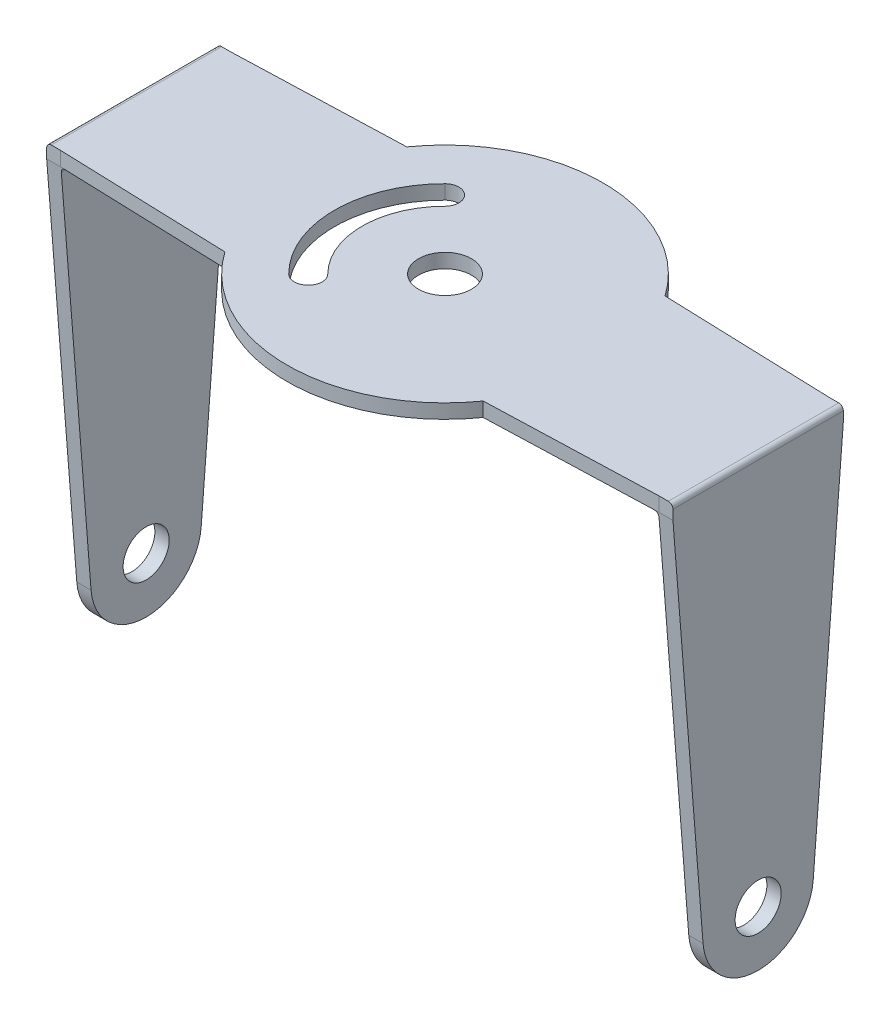
ISO-10303-21;
HEADER;
FILE_DESCRIPTION(('STEP AP214'),'2;1');
FILE_NAME('part.step','',(''),(''),'','','');
FILE_SCHEMA(('AUTOMOTIVE_DESIGN { 1 0 10303 214 1 1 1 1 }'));
ENDSEC;
DATA;
#1=APPLICATION_CONTEXT('core data for automotive mechanical design processes');
#2=APPLICATION_PROTOCOL_DEFINITION('international standard','automotive_design',2000,#1);
#3=PRODUCT_CONTEXT('',#1,'mechanical');
#4=PRODUCT('Part','Part','',(#3));
#5=PRODUCT_RELATED_PRODUCT_CATEGORY('part','',(#4));
#6=PRODUCT_DEFINITION_FORMATION('','',#4);
#7=PRODUCT_DEFINITION_CONTEXT('part definition',#1,'design');
#8=PRODUCT_DEFINITION('design','',#6,#7);
#9=PRODUCT_DEFINITION_SHAPE('','',#8);
#10=(LENGTH_UNIT() NAMED_UNIT(*) SI_UNIT(.MILLI.,.METRE.));
#11=(NAMED_UNIT(*) PLANE_ANGLE_UNIT() SI_UNIT($,.RADIAN.));
#12=(NAMED_UNIT(*) SI_UNIT($,.STERADIAN.) SOLID_ANGLE_UNIT());
#13=UNCERTAINTY_MEASURE_WITH_UNIT(LENGTH_MEASURE(1.E-05),#10,'distance_accuracy_value','');
#14=(GEOMETRIC_REPRESENTATION_CONTEXT(3) GLOBAL_UNCERTAINTY_ASSIGNED_CONTEXT((#13)) GLOBAL_UNIT_ASSIGNED_CONTEXT((#10,
#11,#12)) REPRESENTATION_CONTEXT('',''));
#15=CARTESIAN_POINT('',(0.,0.,0.));
#16=DIRECTION('',(0.,0.,1.));
#17=DIRECTION('',(1.,0.,0.));
#18=AXIS2_PLACEMENT_3D('',#15,#16,#17);
#19=CARTESIAN_POINT('',(34.,-6.,17.15));
#20=DIRECTION('',(-1.,0.,0.));
#21=DIRECTION('',(0.,0.,1.));
#22=AXIS2_PLACEMENT_3D('',#19,#20,#21);
#23=PLANE('',#22);
#24=CARTESIAN_POINT('',(34.,0.,0.));
#25=DIRECTION('',(-1.,0.,0.));
#26=DIRECTION('',(0.,0.,1.));
#27=AXIS2_PLACEMENT_3D('',#24,#25,#26);
#28=CIRCLE('',#27,2.5);
#29=CARTESIAN_POINT('',(34.,0.,2.5));
#30=VERTEX_POINT('',#29);
#31=EDGE_CURVE('E744',#30,#30,#28,.T.);
#32=ORIENTED_EDGE('',*,*,#31,.T.);
#33=EDGE_LOOP('',(#32));
#34=FACE_BOUND('',#33,.T.);
#35=DIRECTION('',(0.,1.,0.));
#36=VECTOR('',#35,1.);
#37=CARTESIAN_POINT('',(34.,-6.00000000000002,-9.25));
#38=LINE('',#37,#36);
#39=CARTESIAN_POINT('',(34.,40.95,-9.25));
#40=VERTEX_POINT('',#39);
#41=CARTESIAN_POINT('',(34.,42.,-9.25));
#42=VERTEX_POINT('',#41);
#43=EDGE_CURVE('E261',#40,#42,#38,.T.);
#44=ORIENTED_EDGE('',*,*,#43,.T.);
#45=DIRECTION('',(0.,0.,-1.));
#46=VECTOR('',#45,1.);
#47=CARTESIAN_POINT('',(34.,42.,17.15));
#48=LINE('',#47,#46);
#49=CARTESIAN_POINT('',(34.,42.,9.25));
#50=VERTEX_POINT('',#49);
#51=EDGE_CURVE('E389',#42,#50,#48,.F.);
#52=ORIENTED_EDGE('',*,*,#51,.T.);
#53=DIRECTION('',(0.,1.,0.));
#54=VECTOR('',#53,1.);
#55=CARTESIAN_POINT('',(34.,-6.00000000000002,9.25));
#56=LINE('',#55,#54);
#57=CARTESIAN_POINT('',(34.,40.95,9.25));
#58=VERTEX_POINT('',#57);
#59=EDGE_CURVE('E265',#58,#50,#56,.T.);
#60=ORIENTED_EDGE('',*,*,#59,.F.);
#61=DIRECTION('',(0.,0.996901100707089,0.0786650837983044));
#62=VECTOR('',#61,1.);
#63=CARTESIAN_POINT('',(34.,-0.471990502789828,5.98140660424254));
#64=LINE('',#63,#62);
#65=CARTESIAN_POINT('',(34.,-0.471990502789828,5.98140660424254));
#66=VERTEX_POINT('',#65);
#67=EDGE_CURVE('E330',#66,#58,#64,.T.);
#68=ORIENTED_EDGE('',*,*,#67,.F.);
#69=CARTESIAN_POINT('',(34.,0.,0.));
#70=DIRECTION('',(1.,0.,0.));
#71=DIRECTION('',(0.,0.,1.));
#72=AXIS2_PLACEMENT_3D('',#69,#70,#71);
#73=CIRCLE('',#72,6.00000000000001);
#74=CARTESIAN_POINT('',(34.,-0.471990502789828,-5.98140660424254));
#75=VERTEX_POINT('',#74);
#76=EDGE_CURVE('E351',#66,#75,#73,.T.);
#77=ORIENTED_EDGE('',*,*,#76,.T.);
#78=DIRECTION('',(0.,0.996901100707089,-0.0786650837983044));
#79=VECTOR('',#78,1.);
#80=CARTESIAN_POINT('',(34.,-0.471990502789828,-5.98140660424254));
#81=LINE('',#80,#79);
#82=EDGE_CURVE('E354',#75,#40,#81,.T.);
#83=ORIENTED_EDGE('',*,*,#82,.T.);
#84=EDGE_LOOP('',(#44,#52,#60,#68,#77,#83));
#85=FACE_BOUND('',#84,.T.);
#86=ADVANCED_FACE('F33',(#34,#85),#23,.F.);
#87=CARTESIAN_POINT('',(-32.45,40.95,17.15));
#88=DIRECTION('',(0.,1.,0.));
#89=DIRECTION('',(-1.,0.,0.));
#90=AXIS2_PLACEMENT_3D('',#87,#88,#89);
#91=PLANE('',#90);
#92=CARTESIAN_POINT('',(0.,40.95,0.));
#93=DIRECTION('',(0.,1.,0.));
#94=DIRECTION('',(-1.,0.,0.));
#95=AXIS2_PLACEMENT_3D('',#92,#93,#94);
#96=CIRCLE('',#95,2.875);
#97=CARTESIAN_POINT('',(-2.875,40.95,0.));
#98=VERTEX_POINT('',#97);
#99=EDGE_CURVE('E253',#98,#98,#96,.T.);
#100=ORIENTED_EDGE('',*,*,#99,.T.);
#101=EDGE_LOOP('',(#100));
#102=FACE_BOUND('',#101,.T.);
#103=CARTESIAN_POINT('',(0.,40.95,0.));
#104=DIRECTION('',(0.,1.,0.));
#105=DIRECTION('',(-1.,0.,0.));
#106=AXIS2_PLACEMENT_3D('',#103,#104,#105);
#107=CIRCLE('',#106,9.00000000000001);
#108=CARTESIAN_POINT('',(-6.36396103067892,40.95,6.36396103067894));
#109=VERTEX_POINT('',#108);
#110=CARTESIAN_POINT('',(-6.36396103067892,40.95,-6.36396103067894));
#111=VERTEX_POINT('',#110);
#112=EDGE_CURVE('E247',#109,#111,#107,.F.);
#113=ORIENTED_EDGE('',*,*,#112,.T.);
#114=CARTESIAN_POINT('',(-7.42462120245874,40.95,-7.42462120245877));
#115=DIRECTION('',(0.,1.,0.));
#116=DIRECTION('',(-1.,0.,0.));
#117=AXIS2_PLACEMENT_3D('',#114,#115,#116);
#118=CIRCLE('',#117,1.5);
#119=CARTESIAN_POINT('',(-8.48528137423856,40.95,-8.48528137423859));
#120=VERTEX_POINT('',#119);
#121=EDGE_CURVE('E250',#111,#120,#118,.T.);
#122=ORIENTED_EDGE('',*,*,#121,.T.);
#123=CARTESIAN_POINT('',(0.,40.95,0.));
#124=DIRECTION('',(0.,1.,0.));
#125=DIRECTION('',(-1.,0.,0.));
#126=AXIS2_PLACEMENT_3D('',#123,#124,#125);
#127=CIRCLE('',#126,12.);
#128=CARTESIAN_POINT('',(-8.48528137423856,40.95,8.48528137423859));
#129=VERTEX_POINT('',#128);
#130=EDGE_CURVE('E244',#120,#129,#127,.T.);
#131=ORIENTED_EDGE('',*,*,#130,.T.);
#132=CARTESIAN_POINT('',(-7.42462120245874,40.95,7.42462120245877));
#133=DIRECTION('',(0.,1.,0.));
#134=DIRECTION('',(-1.,0.,0.));
#135=AXIS2_PLACEMENT_3D('',#132,#133,#134);
#136=CIRCLE('',#135,1.5);
#137=EDGE_CURVE('E216',#129,#109,#136,.T.);
#138=ORIENTED_EDGE('',*,*,#137,.T.);
#139=EDGE_LOOP('',(#113,#122,#131,#138));
#140=FACE_BOUND('',#139,.T.);
#141=DIRECTION('',(-1.,0.,0.));
#142=VECTOR('',#141,1.);
#143=CARTESIAN_POINT('',(34.,40.95,-9.25));
#144=LINE('',#143,#142);
#145=CARTESIAN_POINT('',(32.5,40.95,-9.25));
#146=VERTEX_POINT('',#145);
#147=CARTESIAN_POINT('',(31.95,40.95,-9.25));
#148=VERTEX_POINT('',#147);
#149=EDGE_CURVE('E366',#146,#148,#144,.T.);
#150=ORIENTED_EDGE('',*,*,#149,.T.);
#151=DIRECTION('',(0.,0.,-1.));
#152=VECTOR('',#151,1.);
#153=CARTESIAN_POINT('',(31.95,40.95,9.25));
#154=LINE('',#153,#152);
#155=CARTESIAN_POINT('',(31.95,40.95,9.25));
#156=VERTEX_POINT('',#155);
#157=EDGE_CURVE('E399',#148,#156,#154,.F.);
#158=ORIENTED_EDGE('',*,*,#157,.T.);
#159=DIRECTION('',(-1.,0.,0.));
#160=VECTOR('',#159,1.);
#161=CARTESIAN_POINT('',(34.,40.95,9.25));
#162=LINE('',#161,#160);
#163=CARTESIAN_POINT('',(32.5,40.95,9.25));
#164=VERTEX_POINT('',#163);
#165=EDGE_CURVE('E344',#164,#156,#162,.T.);
#166=ORIENTED_EDGE('',*,*,#165,.F.);
#167=DIRECTION('',(0.999428479818494,0.,-0.033804048983714));
#168=VECTOR('',#167,1.);
#169=CARTESIAN_POINT('',(-32.6426801047576,40.95,11.4533456056721));
#170=LINE('',#169,#168);
#171=CARTESIAN_POINT('',(14.0216573556766,40.95,9.875));
#172=VERTEX_POINT('',#171);
#173=EDGE_CURVE('E287',#172,#164,#170,.T.);
#174=ORIENTED_EDGE('',*,*,#173,.F.);
#175=CARTESIAN_POINT('',(0.,40.95,0.));
#176=DIRECTION('',(0.,1.,0.));
#177=DIRECTION('',(-1.,0.,0.));
#178=AXIS2_PLACEMENT_3D('',#175,#176,#177);
#179=CIRCLE('',#178,17.15);
#180=CARTESIAN_POINT('',(-14.0216573556766,40.95,9.875));
#181=VERTEX_POINT('',#180);
#182=EDGE_CURVE('E323',#172,#181,#179,.F.);
#183=ORIENTED_EDGE('',*,*,#182,.T.);
#184=DIRECTION('',(-0.999428479818494,0.,-0.033804048983714));
#185=VECTOR('',#184,1.);
#186=CARTESIAN_POINT('',(-32.1831577743151,40.95,9.26071667491315));
#187=LINE('',#186,#185);
#188=CARTESIAN_POINT('',(-32.5,40.95,9.25));
#189=VERTEX_POINT('',#188);
#190=EDGE_CURVE('E326',#181,#189,#187,.T.);
#191=ORIENTED_EDGE('',*,*,#190,.T.);
#192=CARTESIAN_POINT('',(-31.95,40.95,9.25));
#193=VERTEX_POINT('',#192);
#194=EDGE_CURVE('E345',#193,#189,#162,.T.);
#195=ORIENTED_EDGE('',*,*,#194,.F.);
#196=DIRECTION('',(0.,0.,-1.));
#197=VECTOR('',#196,1.);
#198=CARTESIAN_POINT('',(-31.95,40.95,-9.25));
#199=LINE('',#198,#197);
#200=CARTESIAN_POINT('',(-31.95,40.95,-9.25));
#201=VERTEX_POINT('',#200);
#202=EDGE_CURVE('E396',#193,#201,#199,.T.);
#203=ORIENTED_EDGE('',*,*,#202,.T.);
#204=CARTESIAN_POINT('',(-32.5,40.95,-9.25));
#205=VERTEX_POINT('',#204);
#206=EDGE_CURVE('E367',#201,#205,#144,.T.);
#207=ORIENTED_EDGE('',*,*,#206,.T.);
#208=DIRECTION('',(0.999428479818494,0.,-0.033804048983714));
#209=VECTOR('',#208,1.);
#210=CARTESIAN_POINT('',(-33.3419739888765,40.95,-9.22152159405327));
#211=LINE('',#210,#209);
#212=CARTESIAN_POINT('',(-14.0216573556766,40.95,-9.875));
#213=VERTEX_POINT('',#212);
#214=EDGE_CURVE('E320',#205,#213,#211,.T.);
#215=ORIENTED_EDGE('',*,*,#214,.T.);
#216=CARTESIAN_POINT('',(0.,40.95,0.));
#217=DIRECTION('',(0.,1.,0.));
#218=DIRECTION('',(-1.,0.,0.));
#219=AXIS2_PLACEMENT_3D('',#216,#217,#218);
#220=CIRCLE('',#219,17.15);
#221=CARTESIAN_POINT('',(14.0216573556766,40.95,-9.875));
#222=VERTEX_POINT('',#221);
#223=EDGE_CURVE('E302',#213,#222,#220,.F.);
#224=ORIENTED_EDGE('',*,*,#223,.T.);
#225=DIRECTION('',(-0.999428479818494,0.,-0.033804048983714));
#226=VECTOR('',#225,1.);
#227=CARTESIAN_POINT('',(-31.4838638901962,40.95,-11.4141505248122));
#228=LINE('',#227,#226);
#229=EDGE_CURVE('E268',#146,#222,#228,.T.);
#230=ORIENTED_EDGE('',*,*,#229,.F.);
#231=EDGE_LOOP('',(#150,#158,#166,#174,#183,#191,#195,#203,#207,#215,#224,#230));
#232=FACE_BOUND('',#231,.T.);
#233=ADVANCED_FACE('F446',(#102,#140,#232),#91,.F.);
#234=CARTESIAN_POINT('',(-34.,42.5,17.15));
#235=DIRECTION('',(0.,-1.,0.));
#236=DIRECTION('',(1.,0.,0.));
#237=AXIS2_PLACEMENT_3D('',#234,#235,#236);
#238=PLANE('',#237);
#239=CARTESIAN_POINT('',(0.,42.5,0.));
#240=DIRECTION('',(0.,1.,0.));
#241=DIRECTION('',(-1.,0.,0.));
#242=AXIS2_PLACEMENT_3D('',#239,#240,#241);
#243=CIRCLE('',#242,2.875);
#244=CARTESIAN_POINT('',(-2.875,42.5,0.));
#245=VERTEX_POINT('',#244);
#246=EDGE_CURVE('E241',#245,#245,#243,.T.);
#247=ORIENTED_EDGE('',*,*,#246,.F.);
#248=EDGE_LOOP('',(#247));
#249=FACE_BOUND('',#248,.T.);
#250=CARTESIAN_POINT('',(0.,42.5,0.));
#251=DIRECTION('',(0.,1.,0.));
#252=DIRECTION('',(-1.,0.,0.));
#253=AXIS2_PLACEMENT_3D('',#250,#251,#252);
#254=CIRCLE('',#253,12.);
#255=CARTESIAN_POINT('',(-8.48528137423856,42.5,-8.48528137423859));
#256=VERTEX_POINT('',#255);
#257=CARTESIAN_POINT('',(-8.48528137423856,42.5,8.48528137423859));
#258=VERTEX_POINT('',#257);
#259=EDGE_CURVE('E224',#256,#258,#254,.T.);
#260=ORIENTED_EDGE('',*,*,#259,.F.);
#261=CARTESIAN_POINT('',(-7.42462120245874,42.5,-7.42462120245877));
#262=DIRECTION('',(0.,1.,0.));
#263=DIRECTION('',(-1.,0.,0.));
#264=AXIS2_PLACEMENT_3D('',#261,#262,#263);
#265=CIRCLE('',#264,1.5);
#266=CARTESIAN_POINT('',(-6.36396103067892,42.5,-6.36396103067894));
#267=VERTEX_POINT('',#266);
#268=EDGE_CURVE('E229',#267,#256,#265,.T.);
#269=ORIENTED_EDGE('',*,*,#268,.F.);
#270=CARTESIAN_POINT('',(0.,42.5,0.));
#271=DIRECTION('',(0.,-1.,0.));
#272=DIRECTION('',(-1.,0.,0.));
#273=AXIS2_PLACEMENT_3D('',#270,#271,#272);
#274=CIRCLE('',#273,9.00000000000001);
#275=CARTESIAN_POINT('',(-6.36396103067892,42.5,6.36396103067894));
#276=VERTEX_POINT('',#275);
#277=EDGE_CURVE('E234',#276,#267,#274,.T.);
#278=ORIENTED_EDGE('',*,*,#277,.F.);
#279=CARTESIAN_POINT('',(-7.42462120245874,42.5,7.42462120245877));
#280=DIRECTION('',(0.,1.,0.));
#281=DIRECTION('',(-1.,0.,0.));
#282=AXIS2_PLACEMENT_3D('',#279,#280,#281);
#283=CIRCLE('',#282,1.5);
#284=EDGE_CURVE('E213',#258,#276,#283,.T.);
#285=ORIENTED_EDGE('',*,*,#284,.F.);
#286=EDGE_LOOP('',(#260,#269,#278,#285));
#287=FACE_BOUND('',#286,.T.);
#288=DIRECTION('',(1.,0.,0.));
#289=VECTOR('',#288,1.);
#290=CARTESIAN_POINT('',(32.5,42.5,9.25));
#291=LINE('',#290,#289);
#292=CARTESIAN_POINT('',(32.5,42.5,9.25));
#293=VERTEX_POINT('',#292);
#294=CARTESIAN_POINT('',(33.5,42.5,9.25));
#295=VERTEX_POINT('',#294);
#296=EDGE_CURVE('E257',#293,#295,#291,.T.);
#297=ORIENTED_EDGE('',*,*,#296,.T.);
#298=DIRECTION('',(0.,0.,-1.));
#299=VECTOR('',#298,1.);
#300=CARTESIAN_POINT('',(33.5,42.5,17.15));
#301=LINE('',#300,#299);
#302=CARTESIAN_POINT('',(33.5,42.5,-9.25));
#303=VERTEX_POINT('',#302);
#304=EDGE_CURVE('E384',#295,#303,#301,.T.);
#305=ORIENTED_EDGE('',*,*,#304,.T.);
#306=DIRECTION('',(-1.,0.,0.));
#307=VECTOR('',#306,1.);
#308=CARTESIAN_POINT('',(32.5,42.5,-9.25));
#309=LINE('',#308,#307);
#310=CARTESIAN_POINT('',(32.5,42.5,-9.25));
#311=VERTEX_POINT('',#310);
#312=EDGE_CURVE('E275',#303,#311,#309,.T.);
#313=ORIENTED_EDGE('',*,*,#312,.T.);
#314=DIRECTION('',(-0.999428479818494,0.,-0.033804048983714));
#315=VECTOR('',#314,1.);
#316=CARTESIAN_POINT('',(32.5,42.5,-9.25));
#317=LINE('',#316,#315);
#318=CARTESIAN_POINT('',(14.0216573556766,42.5,-9.875));
#319=VERTEX_POINT('',#318);
#320=EDGE_CURVE('E256',#311,#319,#317,.T.);
#321=ORIENTED_EDGE('',*,*,#320,.T.);
#322=CARTESIAN_POINT('',(0.,42.5,0.));
#323=DIRECTION('',(0.,-1.,0.));
#324=DIRECTION('',(1.,0.,0.));
#325=AXIS2_PLACEMENT_3D('',#322,#323,#324);
#326=CIRCLE('',#325,17.15);
#327=CARTESIAN_POINT('',(-14.0216573556766,42.5,-9.875));
#328=VERTEX_POINT('',#327);
#329=EDGE_CURVE('E289',#328,#319,#326,.T.);
#330=ORIENTED_EDGE('',*,*,#329,.F.);
#331=DIRECTION('',(0.999428479818494,0.,-0.033804048983714));
#332=VECTOR('',#331,1.);
#333=CARTESIAN_POINT('',(-32.5,42.5,-9.25));
#334=LINE('',#333,#332);
#335=CARTESIAN_POINT('',(-32.5,42.5,-9.25));
#336=VERTEX_POINT('',#335);
#337=EDGE_CURVE('E309',#336,#328,#334,.T.);
#338=ORIENTED_EDGE('',*,*,#337,.F.);
#339=DIRECTION('',(1.,0.,0.));
#340=VECTOR('',#339,1.);
#341=CARTESIAN_POINT('',(-32.5,42.5,-9.25));
#342=LINE('',#341,#340);
#343=CARTESIAN_POINT('',(-33.5,42.5,-9.25));
#344=VERTEX_POINT('',#343);
#345=EDGE_CURVE('E307',#344,#336,#342,.T.);
#346=ORIENTED_EDGE('',*,*,#345,.F.);
#347=DIRECTION('',(0.,0.,-1.));
#348=VECTOR('',#347,1.);
#349=CARTESIAN_POINT('',(-33.5,42.5,17.15));
#350=LINE('',#349,#348);
#351=CARTESIAN_POINT('',(-33.5,42.5,9.25));
#352=VERTEX_POINT('',#351);
#353=EDGE_CURVE('E382',#344,#352,#350,.F.);
#354=ORIENTED_EDGE('',*,*,#353,.T.);
#355=DIRECTION('',(-1.,0.,0.));
#356=VECTOR('',#355,1.);
#357=CARTESIAN_POINT('',(-32.5,42.5,9.25));
#358=LINE('',#357,#356);
#359=CARTESIAN_POINT('',(-32.5,42.5,9.25));
#360=VERTEX_POINT('',#359);
#361=EDGE_CURVE('E290',#360,#352,#358,.T.);
#362=ORIENTED_EDGE('',*,*,#361,.F.);
#363=DIRECTION('',(-0.999428479818494,0.,-0.033804048983714));
#364=VECTOR('',#363,1.);
#365=CARTESIAN_POINT('',(-32.5,42.5,9.25));
#366=LINE('',#365,#364);
#367=CARTESIAN_POINT('',(-14.0216573556766,42.5,9.875));
#368=VERTEX_POINT('',#367);
#369=EDGE_CURVE('E296',#368,#360,#366,.T.);
#370=ORIENTED_EDGE('',*,*,#369,.F.);
#371=CARTESIAN_POINT('',(0.,42.5,0.));
#372=DIRECTION('',(0.,-1.,0.));
#373=DIRECTION('',(-1.,0.,0.));
#374=AXIS2_PLACEMENT_3D('',#371,#372,#373);
#375=CIRCLE('',#374,17.15);
#376=CARTESIAN_POINT('',(14.0216573556766,42.5,9.875));
#377=VERTEX_POINT('',#376);
#378=EDGE_CURVE('E292',#377,#368,#375,.T.);
#379=ORIENTED_EDGE('',*,*,#378,.F.);
#380=DIRECTION('',(0.999428479818494,0.,-0.033804048983714));
#381=VECTOR('',#380,1.);
#382=CARTESIAN_POINT('',(32.5,42.5,9.25));
#383=LINE('',#382,#381);
#384=EDGE_CURVE('E260',#377,#293,#383,.T.);
#385=ORIENTED_EDGE('',*,*,#384,.T.);
#386=EDGE_LOOP('',(#297,#305,#313,#321,#330,#338,#346,#354,#362,#370,#379,#385));
#387=FACE_BOUND('',#386,.T.);
#388=ADVANCED_FACE('F231',(#249,#287,#387),#238,.F.);
#389=CARTESIAN_POINT('',(-32.45,-6.,17.15));
#390=DIRECTION('',(-1.,0.,0.));
#391=DIRECTION('',(0.,0.,1.));
#392=AXIS2_PLACEMENT_3D('',#389,#390,#391);
#393=PLANE('',#392);
#394=CARTESIAN_POINT('',(-32.45,0.,0.));
#395=DIRECTION('',(-1.,0.,0.));
#396=DIRECTION('',(0.,0.,1.));
#397=AXIS2_PLACEMENT_3D('',#394,#395,#396);
#398=CIRCLE('',#397,2.5);
#399=CARTESIAN_POINT('',(-32.45,0.,2.5));
#400=VERTEX_POINT('',#399);
#401=EDGE_CURVE('E748',#400,#400,#398,.T.);
#402=ORIENTED_EDGE('',*,*,#401,.T.);
#403=EDGE_LOOP('',(#402));
#404=FACE_BOUND('',#403,.T.);
#405=DIRECTION('',(0.,0.996901100707089,-0.0786650837983044));
#406=VECTOR('',#405,1.);
#407=CARTESIAN_POINT('',(-32.45,-7.77978677326739,-5.40475120122382));
#408=LINE('',#407,#406);
#409=CARTESIAN_POINT('',(-32.45,-0.471990502789828,-5.98140660424254));
#410=VERTEX_POINT('',#409);
#411=CARTESIAN_POINT('',(-32.45,40.45,-9.21054519162307));
#412=VERTEX_POINT('',#411);
#413=EDGE_CURVE('E373',#410,#412,#408,.T.);
#414=ORIENTED_EDGE('',*,*,#413,.T.);
#415=DIRECTION('',(0.,0.,-1.));
#416=VECTOR('',#415,1.);
#417=CARTESIAN_POINT('',(-32.45,40.45,9.25));
#418=LINE('',#417,#416);
#419=CARTESIAN_POINT('',(-32.45,40.45,9.21054519162307));
#420=VERTEX_POINT('',#419);
#421=EDGE_CURVE('E402',#412,#420,#418,.F.);
#422=ORIENTED_EDGE('',*,*,#421,.T.);
#423=DIRECTION('',(0.,0.996901100707089,0.0786650837983044));
#424=VECTOR('',#423,1.);
#425=CARTESIAN_POINT('',(-32.45,-5.08993588740434,5.61700630375232));
#426=LINE('',#425,#424);
#427=CARTESIAN_POINT('',(-32.45,-0.471990502789828,5.98140660424254));
#428=VERTEX_POINT('',#427);
#429=EDGE_CURVE('E347',#428,#420,#426,.T.);
#430=ORIENTED_EDGE('',*,*,#429,.F.);
#431=CARTESIAN_POINT('',(-32.45,0.,0.));
#432=DIRECTION('',(-1.,0.,0.));
#433=DIRECTION('',(0.,0.,1.));
#434=AXIS2_PLACEMENT_3D('',#431,#432,#433);
#435=CIRCLE('',#434,6.00000000000001);
#436=EDGE_CURVE('E379',#428,#410,#435,.F.);
#437=ORIENTED_EDGE('',*,*,#436,.T.);
#438=EDGE_LOOP('',(#414,#422,#430,#437));
#439=FACE_BOUND('',#438,.T.);
#440=ADVANCED_FACE('F422',(#404,#439),#393,.F.);
#441=CARTESIAN_POINT('',(32.45,-6.,17.15));
#442=DIRECTION('',(1.,0.,0.));
#443=DIRECTION('',(0.,0.,-1.));
#444=AXIS2_PLACEMENT_3D('',#441,#442,#443);
#445=PLANE('',#444);
#446=CARTESIAN_POINT('',(32.45,0.,0.));
#447=DIRECTION('',(1.,0.,0.));
#448=DIRECTION('',(0.,0.,-1.));
#449=AXIS2_PLACEMENT_3D('',#446,#447,#448);
#450=CIRCLE('',#449,2.5);
#451=CARTESIAN_POINT('',(32.45,0.,-2.5));
#452=VERTEX_POINT('',#451);
#453=EDGE_CURVE('E747',#452,#452,#450,.T.);
#454=ORIENTED_EDGE('',*,*,#453,.T.);
#455=EDGE_LOOP('',(#454));
#456=FACE_BOUND('',#455,.T.);
#457=DIRECTION('',(0.,-0.996901100707089,-0.0786650837983044));
#458=VECTOR('',#457,1.);
#459=CARTESIAN_POINT('',(32.45,-5.08993588740433,5.61700630375232));
#460=LINE('',#459,#458);
#461=CARTESIAN_POINT('',(32.45,40.45,9.21054519162307));
#462=VERTEX_POINT('',#461);
#463=CARTESIAN_POINT('',(32.45,-0.471990502789828,5.98140660424254));
#464=VERTEX_POINT('',#463);
#465=EDGE_CURVE('E339',#462,#464,#460,.T.);
#466=ORIENTED_EDGE('',*,*,#465,.F.);
#467=DIRECTION('',(0.,0.,-1.));
#468=VECTOR('',#467,1.);
#469=CARTESIAN_POINT('',(32.45,40.45,-9.25));
#470=LINE('',#469,#468);
#471=CARTESIAN_POINT('',(32.45,40.45,-9.21054519162307));
#472=VERTEX_POINT('',#471);
#473=EDGE_CURVE('E393',#462,#472,#470,.T.);
#474=ORIENTED_EDGE('',*,*,#473,.T.);
#475=DIRECTION('',(0.,-0.996901100707089,0.0786650837983044));
#476=VECTOR('',#475,1.);
#477=CARTESIAN_POINT('',(32.45,-7.77978677326739,-5.40475120122382));
#478=LINE('',#477,#476);
#479=CARTESIAN_POINT('',(32.45,-0.471990502789828,-5.98140660424254));
#480=VERTEX_POINT('',#479);
#481=EDGE_CURVE('E365',#472,#480,#478,.T.);
#482=ORIENTED_EDGE('',*,*,#481,.T.);
#483=CARTESIAN_POINT('',(32.45,0.,0.));
#484=DIRECTION('',(1.,0.,0.));
#485=DIRECTION('',(0.,0.,-1.));
#486=AXIS2_PLACEMENT_3D('',#483,#484,#485);
#487=CIRCLE('',#486,6.00000000000001);
#488=EDGE_CURVE('E376',#480,#464,#487,.F.);
#489=ORIENTED_EDGE('',*,*,#488,.T.);
#490=EDGE_LOOP('',(#466,#474,#482,#489));
#491=FACE_BOUND('',#490,.T.);
#492=ADVANCED_FACE('F462',(#456,#491),#445,.F.);
#493=CARTESIAN_POINT('',(-34.,-6.,17.15));
#494=DIRECTION('',(1.,0.,0.));
#495=DIRECTION('',(0.,0.,-1.));
#496=AXIS2_PLACEMENT_3D('',#493,#494,#495);
#497=PLANE('',#496);
#498=CARTESIAN_POINT('',(-34.,0.,0.));
#499=DIRECTION('',(-1.,0.,0.));
#500=DIRECTION('',(0.,0.,1.));
#501=AXIS2_PLACEMENT_3D('',#498,#499,#500);
#502=CIRCLE('',#501,2.5);
#503=CARTESIAN_POINT('',(-34.,0.,2.5));
#504=VERTEX_POINT('',#503);
#505=EDGE_CURVE('E752',#504,#504,#502,.T.);
#506=ORIENTED_EDGE('',*,*,#505,.F.);
#507=EDGE_LOOP('',(#506));
#508=FACE_BOUND('',#507,.T.);
#509=DIRECTION('',(0.,1.,0.));
#510=VECTOR('',#509,1.);
#511=CARTESIAN_POINT('',(-34.,-6.00000000000002,9.25));
#512=LINE('',#511,#510);
#513=CARTESIAN_POINT('',(-34.,40.95,9.25));
#514=VERTEX_POINT('',#513);
#515=CARTESIAN_POINT('',(-34.,42.,9.25));
#516=VERTEX_POINT('',#515);
#517=EDGE_CURVE('E299',#514,#516,#512,.T.);
#518=ORIENTED_EDGE('',*,*,#517,.T.);
#519=DIRECTION('',(0.,0.,-1.));
#520=VECTOR('',#519,1.);
#521=CARTESIAN_POINT('',(-34.,42.,17.15));
#522=LINE('',#521,#520);
#523=CARTESIAN_POINT('',(-34.,42.,-9.25));
#524=VERTEX_POINT('',#523);
#525=EDGE_CURVE('E404',#516,#524,#522,.T.);
#526=ORIENTED_EDGE('',*,*,#525,.T.);
#527=DIRECTION('',(0.,1.,0.));
#528=VECTOR('',#527,1.);
#529=CARTESIAN_POINT('',(-34.,-6.00000000000002,-9.25));
#530=LINE('',#529,#528);
#531=CARTESIAN_POINT('',(-34.,40.95,-9.25));
#532=VERTEX_POINT('',#531);
#533=EDGE_CURVE('E312',#532,#524,#530,.T.);
#534=ORIENTED_EDGE('',*,*,#533,.F.);
#535=DIRECTION('',(0.,0.996901100707089,-0.0786650837983044));
#536=VECTOR('',#535,1.);
#537=CARTESIAN_POINT('',(-34.,-0.471990502789828,-5.98140660424254));
#538=LINE('',#537,#536);
#539=CARTESIAN_POINT('',(-34.,-0.471990502789828,-5.98140660424254));
#540=VERTEX_POINT('',#539);
#541=EDGE_CURVE('E355',#540,#532,#538,.T.);
#542=ORIENTED_EDGE('',*,*,#541,.F.);
#543=CARTESIAN_POINT('',(-34.,0.,0.));
#544=DIRECTION('',(1.,0.,0.));
#545=DIRECTION('',(0.,0.,1.));
#546=AXIS2_PLACEMENT_3D('',#543,#544,#545);
#547=CIRCLE('',#546,6.00000000000001);
#548=CARTESIAN_POINT('',(-34.,-0.471990502789828,5.98140660424254));
#549=VERTEX_POINT('',#548);
#550=EDGE_CURVE('E350',#549,#540,#547,.T.);
#551=ORIENTED_EDGE('',*,*,#550,.F.);
#552=DIRECTION('',(0.,0.996901100707089,0.0786650837983044));
#553=VECTOR('',#552,1.);
#554=CARTESIAN_POINT('',(-34.,-0.471990502789828,5.98140660424254));
#555=LINE('',#554,#553);
#556=EDGE_CURVE('E329',#549,#514,#555,.T.);
#557=ORIENTED_EDGE('',*,*,#556,.T.);
#558=EDGE_LOOP('',(#518,#526,#534,#542,#551,#557));
#559=FACE_BOUND('',#558,.T.);
#560=ADVANCED_FACE('F438',(#508,#559),#497,.F.);
#561=CARTESIAN_POINT('',(34.,-0.471990502789828,-5.98140660424254));
#562=DIRECTION('',(0.,0.0786650837983044,0.996901100707089));
#563=DIRECTION('',(0.,-0.996901100707089,0.0786650837983044));
#564=AXIS2_PLACEMENT_3D('',#561,#562,#563);
#565=PLANE('',#564);
#566=EDGE_CURVE('E363',#40,#146,#144,.T.);
#567=ORIENTED_EDGE('',*,*,#566,.F.);
#568=ORIENTED_EDGE('',*,*,#82,.F.);
#569=DIRECTION('',(-1.,0.,0.));
#570=VECTOR('',#569,1.);
#571=CARTESIAN_POINT('',(34.,-0.471990502789828,-5.98140660424254));
#572=LINE('',#571,#570);
#573=EDGE_CURVE('E368',#75,#480,#572,.T.);
#574=ORIENTED_EDGE('',*,*,#573,.T.);
#575=ORIENTED_EDGE('',*,*,#481,.F.);
#576=CARTESIAN_POINT('',(31.95,40.45,-9.21054519162307));
#577=DIRECTION('',(0.,0.0786650837983044,0.996901100707089));
#578=DIRECTION('',(0.,-0.996901100707089,0.0786650837983044));
#579=AXIS2_PLACEMENT_3D('',#576,#577,#578);
#580=ELLIPSE('',#579,0.501554266160762,0.5);
#581=EDGE_CURVE('E408',#472,#148,#580,.T.);
#582=ORIENTED_EDGE('',*,*,#581,.T.);
#583=ORIENTED_EDGE('',*,*,#149,.F.);
#584=EDGE_LOOP('',(#567,#568,#574,#575,#582,#583));
#585=FACE_BOUND('',#584,.T.);
#586=ADVANCED_FACE('F453',(#585),#565,.F.);
#587=CARTESIAN_POINT('',(34.,0.,0.));
#588=DIRECTION('',(-1.,0.,0.));
#589=DIRECTION('',(0.,0.,1.));
#590=AXIS2_PLACEMENT_3D('',#587,#588,#589);
#591=CYLINDRICAL_SURFACE('',#590,6.00000000000001);
#592=ORIENTED_EDGE('',*,*,#573,.F.);
#593=ORIENTED_EDGE('',*,*,#76,.F.);
#594=DIRECTION('',(-1.,0.,0.));
#595=VECTOR('',#594,1.);
#596=CARTESIAN_POINT('',(34.,-0.471990502789828,5.98140660424254));
#597=LINE('',#596,#595);
#598=EDGE_CURVE('E336',#66,#464,#597,.T.);
#599=ORIENTED_EDGE('',*,*,#598,.T.);
#600=ORIENTED_EDGE('',*,*,#488,.F.);
#601=EDGE_LOOP('',(#592,#593,#599,#600));
#602=FACE_BOUND('',#601,.T.);
#603=ADVANCED_FACE('F465',(#602),#591,.T.);
#604=ORIENTED_EDGE('',*,*,#436,.F.);
#605=EDGE_CURVE('E340',#428,#549,#597,.T.);
#606=ORIENTED_EDGE('',*,*,#605,.T.);
#607=ORIENTED_EDGE('',*,*,#550,.T.);
#608=EDGE_CURVE('E358',#410,#540,#572,.T.);
#609=ORIENTED_EDGE('',*,*,#608,.F.);
#610=EDGE_LOOP('',(#604,#606,#607,#609));
#611=FACE_BOUND('',#610,.T.);
#612=ADVANCED_FACE('F434',(#611),#591,.T.);
#613=ORIENTED_EDGE('',*,*,#608,.T.);
#614=ORIENTED_EDGE('',*,*,#541,.T.);
#615=EDGE_CURVE('E371',#205,#532,#144,.T.);
#616=ORIENTED_EDGE('',*,*,#615,.F.);
#617=ORIENTED_EDGE('',*,*,#206,.F.);
#618=CARTESIAN_POINT('',(-31.95,40.45,-9.21054519162307));
#619=DIRECTION('',(0.,0.0786650837983044,0.996901100707089));
#620=DIRECTION('',(0.,-0.996901100707089,0.0786650837983044));
#621=AXIS2_PLACEMENT_3D('',#618,#619,#620);
#622=ELLIPSE('',#621,0.501554266160762,0.5);
#623=EDGE_CURVE('E41',#201,#412,#622,.T.);
#624=ORIENTED_EDGE('',*,*,#623,.T.);
#625=ORIENTED_EDGE('',*,*,#413,.F.);
#626=EDGE_LOOP('',(#613,#614,#616,#617,#624,#625));
#627=FACE_BOUND('',#626,.T.);
#628=ADVANCED_FACE('F414',(#627),#565,.F.);
#629=CARTESIAN_POINT('',(34.,-0.471990502789828,5.98140660424254));
#630=DIRECTION('',(0.,-0.0786650837983044,0.996901100707089));
#631=DIRECTION('',(0.,-0.996901100707089,-0.0786650837983044));
#632=AXIS2_PLACEMENT_3D('',#629,#630,#631);
#633=PLANE('',#632);
#634=ORIENTED_EDGE('',*,*,#429,.T.);
#635=CARTESIAN_POINT('',(-31.95,40.45,9.21054519162307));
#636=DIRECTION('',(0.,-0.0786650837983044,0.996901100707089));
#637=DIRECTION('',(0.,0.996901100707089,0.0786650837983044));
#638=AXIS2_PLACEMENT_3D('',#635,#636,#637);
#639=ELLIPSE('',#638,0.501554266160762,0.5);
#640=EDGE_CURVE('E11',#420,#193,#639,.F.);
#641=ORIENTED_EDGE('',*,*,#640,.T.);
#642=ORIENTED_EDGE('',*,*,#194,.T.);
#643=EDGE_CURVE('E333',#189,#514,#162,.T.);
#644=ORIENTED_EDGE('',*,*,#643,.T.);
#645=ORIENTED_EDGE('',*,*,#556,.F.);
#646=ORIENTED_EDGE('',*,*,#605,.F.);
#647=EDGE_LOOP('',(#634,#641,#642,#644,#645,#646));
#648=FACE_BOUND('',#647,.T.);
#649=ADVANCED_FACE('F428',(#648),#633,.T.);
#650=ORIENTED_EDGE('',*,*,#165,.T.);
#651=CARTESIAN_POINT('',(31.95,40.45,9.21054519162307));
#652=DIRECTION('',(0.,-0.0786650837983044,0.996901100707089));
#653=DIRECTION('',(0.,0.996901100707089,0.0786650837983044));
#654=AXIS2_PLACEMENT_3D('',#651,#652,#653);
#655=ELLIPSE('',#654,0.501554266160762,0.5);
#656=EDGE_CURVE('E411',#156,#462,#655,.F.);
#657=ORIENTED_EDGE('',*,*,#656,.T.);
#658=ORIENTED_EDGE('',*,*,#465,.T.);
#659=ORIENTED_EDGE('',*,*,#598,.F.);
#660=ORIENTED_EDGE('',*,*,#67,.T.);
#661=EDGE_CURVE('E341',#58,#164,#162,.T.);
#662=ORIENTED_EDGE('',*,*,#661,.T.);
#663=EDGE_LOOP('',(#650,#657,#658,#659,#660,#662));
#664=FACE_BOUND('',#663,.T.);
#665=ADVANCED_FACE('F459',(#664),#633,.T.);
#666=CARTESIAN_POINT('',(-32.5,-6.00000000000002,9.25));
#667=DIRECTION('',(0.033804048983714,0.,-0.999428479818494));
#668=DIRECTION('',(-0.999428479818494,0.,-0.033804048983714));
#669=AXIS2_PLACEMENT_3D('',#666,#667,#668);
#670=PLANE('',#669);
#671=DIRECTION('',(0.,1.,0.));
#672=VECTOR('',#671,1.);
#673=CARTESIAN_POINT('',(-14.0216573556766,-6.00000000000002,9.875));
#674=LINE('',#673,#672);
#675=EDGE_CURVE('E303',#181,#368,#674,.T.);
#676=ORIENTED_EDGE('',*,*,#675,.T.);
#677=ORIENTED_EDGE('',*,*,#369,.T.);
#678=DIRECTION('',(0.,1.,0.));
#679=VECTOR('',#678,1.);
#680=CARTESIAN_POINT('',(-32.5,-6.00000000000002,9.25));
#681=LINE('',#680,#679);
#682=EDGE_CURVE('E300',#189,#360,#681,.T.);
#683=ORIENTED_EDGE('',*,*,#682,.F.);
#684=ORIENTED_EDGE('',*,*,#190,.F.);
#685=EDGE_LOOP('',(#676,#677,#683,#684));
#686=FACE_BOUND('',#685,.T.);
#687=ADVANCED_FACE('F498',(#686),#670,.F.);
#688=CARTESIAN_POINT('',(0.,-6.00000000000002,0.));
#689=DIRECTION('',(0.,1.,0.));
#690=DIRECTION('',(-1.,0.,0.));
#691=AXIS2_PLACEMENT_3D('',#688,#689,#690);
#692=CYLINDRICAL_SURFACE('',#691,17.15);
#693=ORIENTED_EDGE('',*,*,#182,.F.);
#694=DIRECTION('',(0.,1.,0.));
#695=VECTOR('',#694,1.);
#696=CARTESIAN_POINT('',(14.0216573556766,-6.00000000000002,9.875));
#697=LINE('',#696,#695);
#698=EDGE_CURVE('E269',#172,#377,#697,.T.);
#699=ORIENTED_EDGE('',*,*,#698,.T.);
#700=ORIENTED_EDGE('',*,*,#378,.T.);
#701=ORIENTED_EDGE('',*,*,#675,.F.);
#702=EDGE_LOOP('',(#693,#699,#700,#701));
#703=FACE_BOUND('',#702,.T.);
#704=ADVANCED_FACE('F503',(#703),#692,.T.);
#705=CARTESIAN_POINT('',(-32.5,-6.00000000000002,9.25));
#706=DIRECTION('',(0.,0.,-1.));
#707=DIRECTION('',(-1.,0.,0.));
#708=AXIS2_PLACEMENT_3D('',#705,#706,#707);
#709=PLANE('',#708);
#710=ORIENTED_EDGE('',*,*,#361,.T.);
#711=CARTESIAN_POINT('',(-33.5,42.,9.25));
#712=DIRECTION('',(0.,0.,-1.));
#713=DIRECTION('',(-1.,0.,0.));
#714=AXIS2_PLACEMENT_3D('',#711,#712,#713);
#715=CIRCLE('',#714,0.5);
#716=EDGE_CURVE('E56',#352,#516,#715,.F.);
#717=ORIENTED_EDGE('',*,*,#716,.T.);
#718=ORIENTED_EDGE('',*,*,#517,.F.);
#719=ORIENTED_EDGE('',*,*,#643,.F.);
#720=ORIENTED_EDGE('',*,*,#682,.T.);
#721=EDGE_LOOP('',(#710,#717,#718,#719,#720));
#722=FACE_BOUND('',#721,.T.);
#723=ADVANCED_FACE('F496',(#722),#709,.F.);
#724=CARTESIAN_POINT('',(-32.5,-6.00000000000002,-9.25));
#725=DIRECTION('',(0.033804048983714,0.,0.999428479818494));
#726=DIRECTION('',(0.999428479818494,0.,-0.033804048983714));
#727=AXIS2_PLACEMENT_3D('',#724,#725,#726);
#728=PLANE('',#727);
#729=DIRECTION('',(0.,1.,0.));
#730=VECTOR('',#729,1.);
#731=CARTESIAN_POINT('',(-32.5,-6.00000000000002,-9.25));
#732=LINE('',#731,#730);
#733=EDGE_CURVE('E314',#205,#336,#732,.T.);
#734=ORIENTED_EDGE('',*,*,#733,.T.);
#735=ORIENTED_EDGE('',*,*,#337,.T.);
#736=DIRECTION('',(0.,1.,0.));
#737=VECTOR('',#736,1.);
#738=CARTESIAN_POINT('',(-14.0216573556766,-6.00000000000002,-9.875));
#739=LINE('',#738,#737);
#740=EDGE_CURVE('E293',#213,#328,#739,.T.);
#741=ORIENTED_EDGE('',*,*,#740,.F.);
#742=ORIENTED_EDGE('',*,*,#214,.F.);
#743=EDGE_LOOP('',(#734,#735,#741,#742));
#744=FACE_BOUND('',#743,.T.);
#745=ADVANCED_FACE('F492',(#744),#728,.F.);
#746=CARTESIAN_POINT('',(0.,-6.00000000000002,0.));
#747=DIRECTION('',(0.,1.,0.));
#748=DIRECTION('',(-1.,0.,0.));
#749=AXIS2_PLACEMENT_3D('',#746,#747,#748);
#750=CYLINDRICAL_SURFACE('',#749,17.15);
#751=ORIENTED_EDGE('',*,*,#740,.T.);
#752=ORIENTED_EDGE('',*,*,#329,.T.);
#753=DIRECTION('',(0.,1.,0.));
#754=VECTOR('',#753,1.);
#755=CARTESIAN_POINT('',(14.0216573556766,-6.00000000000002,-9.875));
#756=LINE('',#755,#754);
#757=EDGE_CURVE('E277',#222,#319,#756,.T.);
#758=ORIENTED_EDGE('',*,*,#757,.F.);
#759=ORIENTED_EDGE('',*,*,#223,.F.);
#760=EDGE_LOOP('',(#751,#752,#758,#759));
#761=FACE_BOUND('',#760,.T.);
#762=ADVANCED_FACE('F489',(#761),#750,.T.);
#763=CARTESIAN_POINT('',(-32.5,-6.00000000000002,-9.25));
#764=DIRECTION('',(0.,0.,1.));
#765=DIRECTION('',(1.,0.,0.));
#766=AXIS2_PLACEMENT_3D('',#763,#764,#765);
#767=PLANE('',#766);
#768=ORIENTED_EDGE('',*,*,#533,.T.);
#769=CARTESIAN_POINT('',(-33.5,42.,-9.25));
#770=DIRECTION('',(0.,0.,1.));
#771=DIRECTION('',(1.,0.,0.));
#772=AXIS2_PLACEMENT_3D('',#769,#770,#771);
#773=CIRCLE('',#772,0.5);
#774=EDGE_CURVE('E48',#524,#344,#773,.F.);
#775=ORIENTED_EDGE('',*,*,#774,.T.);
#776=ORIENTED_EDGE('',*,*,#345,.T.);
#777=ORIENTED_EDGE('',*,*,#733,.F.);
#778=ORIENTED_EDGE('',*,*,#615,.T.);
#779=EDGE_LOOP('',(#768,#775,#776,#777,#778));
#780=FACE_BOUND('',#779,.T.);
#781=ADVANCED_FACE('F440',(#780),#767,.F.);
#782=CARTESIAN_POINT('',(32.5,-6.00000000000002,-9.25));
#783=DIRECTION('',(0.033804048983714,0.,-0.999428479818494));
#784=DIRECTION('',(-0.999428479818494,0.,-0.033804048983714));
#785=AXIS2_PLACEMENT_3D('',#782,#783,#784);
#786=PLANE('',#785);
#787=ORIENTED_EDGE('',*,*,#229,.T.);
#788=ORIENTED_EDGE('',*,*,#757,.T.);
#789=ORIENTED_EDGE('',*,*,#320,.F.);
#790=DIRECTION('',(0.,1.,0.));
#791=VECTOR('',#790,1.);
#792=CARTESIAN_POINT('',(32.5,-6.00000000000002,-9.25));
#793=LINE('',#792,#791);
#794=EDGE_CURVE('E280',#146,#311,#793,.T.);
#795=ORIENTED_EDGE('',*,*,#794,.F.);
#796=EDGE_LOOP('',(#787,#788,#789,#795));
#797=FACE_BOUND('',#796,.T.);
#798=ADVANCED_FACE('F484',(#797),#786,.T.);
#799=CARTESIAN_POINT('',(32.5,-6.00000000000002,-9.25));
#800=DIRECTION('',(0.,0.,-1.));
#801=DIRECTION('',(-1.,0.,0.));
#802=AXIS2_PLACEMENT_3D('',#799,#800,#801);
#803=PLANE('',#802);
#804=ORIENTED_EDGE('',*,*,#312,.F.);
#805=CARTESIAN_POINT('',(33.5,42.,-9.25));
#806=DIRECTION('',(0.,0.,-1.));
#807=DIRECTION('',(-1.,0.,0.));
#808=AXIS2_PLACEMENT_3D('',#805,#806,#807);
#809=CIRCLE('',#808,0.5);
#810=EDGE_CURVE('E387',#303,#42,#809,.T.);
#811=ORIENTED_EDGE('',*,*,#810,.T.);
#812=ORIENTED_EDGE('',*,*,#43,.F.);
#813=ORIENTED_EDGE('',*,*,#566,.T.);
#814=ORIENTED_EDGE('',*,*,#794,.T.);
#815=EDGE_LOOP('',(#804,#811,#812,#813,#814));
#816=FACE_BOUND('',#815,.T.);
#817=ADVANCED_FACE('F480',(#816),#803,.T.);
#818=CARTESIAN_POINT('',(32.5,-6.00000000000002,9.25));
#819=DIRECTION('',(0.033804048983714,0.,0.999428479818494));
#820=DIRECTION('',(0.999428479818494,0.,-0.033804048983714));
#821=AXIS2_PLACEMENT_3D('',#818,#819,#820);
#822=PLANE('',#821);
#823=ORIENTED_EDGE('',*,*,#173,.T.);
#824=DIRECTION('',(0.,1.,0.));
#825=VECTOR('',#824,1.);
#826=CARTESIAN_POINT('',(32.5,-6.00000000000002,9.25));
#827=LINE('',#826,#825);
#828=EDGE_CURVE('E264',#164,#293,#827,.T.);
#829=ORIENTED_EDGE('',*,*,#828,.T.);
#830=ORIENTED_EDGE('',*,*,#384,.F.);
#831=ORIENTED_EDGE('',*,*,#698,.F.);
#832=EDGE_LOOP('',(#823,#829,#830,#831));
#833=FACE_BOUND('',#832,.T.);
#834=ADVANCED_FACE('F506',(#833),#822,.T.);
#835=CARTESIAN_POINT('',(32.5,-6.00000000000002,9.25));
#836=DIRECTION('',(0.,0.,1.));
#837=DIRECTION('',(1.,0.,0.));
#838=AXIS2_PLACEMENT_3D('',#835,#836,#837);
#839=PLANE('',#838);
#840=ORIENTED_EDGE('',*,*,#59,.T.);
#841=CARTESIAN_POINT('',(33.5,42.,9.25));
#842=DIRECTION('',(0.,0.,1.));
#843=DIRECTION('',(1.,0.,0.));
#844=AXIS2_PLACEMENT_3D('',#841,#842,#843);
#845=CIRCLE('',#844,0.5);
#846=EDGE_CURVE('E391',#50,#295,#845,.T.);
#847=ORIENTED_EDGE('',*,*,#846,.T.);
#848=ORIENTED_EDGE('',*,*,#296,.F.);
#849=ORIENTED_EDGE('',*,*,#828,.F.);
#850=ORIENTED_EDGE('',*,*,#661,.F.);
#851=EDGE_LOOP('',(#840,#847,#848,#849,#850));
#852=FACE_BOUND('',#851,.T.);
#853=ADVANCED_FACE('F472',(#852),#839,.T.);
#854=CARTESIAN_POINT('',(-7.42462120245874,8.20000000000001,-7.42462120245877));
#855=DIRECTION('',(0.,1.,0.));
#856=DIRECTION('',(-1.,0.,0.));
#857=AXIS2_PLACEMENT_3D('',#854,#855,#856);
#858=CYLINDRICAL_SURFACE('',#857,1.5);
#859=DIRECTION('',(0.,1.,0.));
#860=VECTOR('',#859,1.);
#861=CARTESIAN_POINT('',(-6.36396103067892,8.20000000000001,-6.36396103067894));
#862=LINE('',#861,#860);
#863=EDGE_CURVE('E239',#111,#267,#862,.T.);
#864=ORIENTED_EDGE('',*,*,#863,.T.);
#865=ORIENTED_EDGE('',*,*,#268,.T.);
#866=DIRECTION('',(0.,1.,0.));
#867=VECTOR('',#866,1.);
#868=CARTESIAN_POINT('',(-8.48528137423856,8.20000000000001,-8.48528137423859));
#869=LINE('',#868,#867);
#870=EDGE_CURVE('E220',#120,#256,#869,.T.);
#871=ORIENTED_EDGE('',*,*,#870,.F.);
#872=ORIENTED_EDGE('',*,*,#121,.F.);
#873=EDGE_LOOP('',(#864,#865,#871,#872));
#874=FACE_BOUND('',#873,.T.);
#875=ADVANCED_FACE('F514',(#874),#858,.F.);
#876=CARTESIAN_POINT('',(0.,8.20000000000001,0.));
#877=DIRECTION('',(0.,1.,0.));
#878=DIRECTION('',(-1.,0.,0.));
#879=AXIS2_PLACEMENT_3D('',#876,#877,#878);
#880=CYLINDRICAL_SURFACE('',#879,9.00000000000001);
#881=DIRECTION('',(0.,1.,0.));
#882=VECTOR('',#881,1.);
#883=CARTESIAN_POINT('',(-6.36396103067892,8.20000000000001,6.36396103067894));
#884=LINE('',#883,#882);
#885=EDGE_CURVE('E219',#109,#276,#884,.T.);
#886=ORIENTED_EDGE('',*,*,#885,.T.);
#887=ORIENTED_EDGE('',*,*,#277,.T.);
#888=ORIENTED_EDGE('',*,*,#863,.F.);
#889=ORIENTED_EDGE('',*,*,#112,.F.);
#890=EDGE_LOOP('',(#886,#887,#888,#889));
#891=FACE_BOUND('',#890,.T.);
#892=ADVANCED_FACE('F689',(#891),#880,.T.);
#893=CARTESIAN_POINT('',(-7.42462120245874,8.20000000000001,7.42462120245877));
#894=DIRECTION('',(0.,1.,0.));
#895=DIRECTION('',(-1.,0.,0.));
#896=AXIS2_PLACEMENT_3D('',#893,#894,#895);
#897=CYLINDRICAL_SURFACE('',#896,1.5);
#898=DIRECTION('',(0.,1.,0.));
#899=VECTOR('',#898,1.);
#900=CARTESIAN_POINT('',(-8.48528137423856,8.20000000000001,8.48528137423859));
#901=LINE('',#900,#899);
#902=EDGE_CURVE('E208',#129,#258,#901,.T.);
#903=ORIENTED_EDGE('',*,*,#902,.T.);
#904=ORIENTED_EDGE('',*,*,#284,.T.);
#905=ORIENTED_EDGE('',*,*,#885,.F.);
#906=ORIENTED_EDGE('',*,*,#137,.F.);
#907=EDGE_LOOP('',(#903,#904,#905,#906));
#908=FACE_BOUND('',#907,.T.);
#909=ADVANCED_FACE('F210',(#908),#897,.F.);
#910=CARTESIAN_POINT('',(0.,8.20000000000001,0.));
#911=DIRECTION('',(0.,1.,0.));
#912=DIRECTION('',(-1.,0.,0.));
#913=AXIS2_PLACEMENT_3D('',#910,#911,#912);
#914=CYLINDRICAL_SURFACE('',#913,12.);
#915=ORIENTED_EDGE('',*,*,#870,.T.);
#916=ORIENTED_EDGE('',*,*,#259,.T.);
#917=ORIENTED_EDGE('',*,*,#902,.F.);
#918=ORIENTED_EDGE('',*,*,#130,.F.);
#919=EDGE_LOOP('',(#915,#916,#917,#918));
#920=FACE_BOUND('',#919,.T.);
#921=ADVANCED_FACE('F225',(#920),#914,.F.);
#922=CARTESIAN_POINT('',(0.,8.20000000000001,0.));
#923=DIRECTION('',(0.,1.,0.));
#924=DIRECTION('',(-1.,0.,0.));
#925=AXIS2_PLACEMENT_3D('',#922,#923,#924);
#926=CYLINDRICAL_SURFACE('',#925,2.875);
#927=ORIENTED_EDGE('',*,*,#246,.T.);
#928=EDGE_LOOP('',(#927));
#929=FACE_BOUND('',#928,.T.);
#930=ORIENTED_EDGE('',*,*,#99,.F.);
#931=EDGE_LOOP('',(#930));
#932=FACE_BOUND('',#931,.T.);
#933=ADVANCED_FACE('F712',(#929,#932),#926,.F.);
#934=CARTESIAN_POINT('',(34.,0.,0.));
#935=DIRECTION('',(-1.,0.,0.));
#936=DIRECTION('',(0.,0.,1.));
#937=AXIS2_PLACEMENT_3D('',#934,#935,#936);
#938=CYLINDRICAL_SURFACE('',#937,2.5);
#939=ORIENTED_EDGE('',*,*,#505,.T.);
#940=EDGE_LOOP('',(#939));
#941=FACE_BOUND('',#940,.T.);
#942=ORIENTED_EDGE('',*,*,#401,.F.);
#943=EDGE_LOOP('',(#942));
#944=FACE_BOUND('',#943,.T.);
#945=ADVANCED_FACE('F720',(#941,#944),#938,.F.);
#946=ORIENTED_EDGE('',*,*,#31,.F.);
#947=EDGE_LOOP('',(#946));
#948=FACE_BOUND('',#947,.T.);
#949=ORIENTED_EDGE('',*,*,#453,.F.);
#950=EDGE_LOOP('',(#949));
#951=FACE_BOUND('',#950,.T.);
#952=ADVANCED_FACE('F540',(#948,#951),#938,.F.);
#953=CARTESIAN_POINT('',(33.5,42.,17.15));
#954=DIRECTION('',(0.,0.,-1.));
#955=DIRECTION('',(-1.,0.,0.));
#956=AXIS2_PLACEMENT_3D('',#953,#954,#955);
#957=CYLINDRICAL_SURFACE('',#956,0.5);
#958=ORIENTED_EDGE('',*,*,#846,.F.);
#959=ORIENTED_EDGE('',*,*,#51,.F.);
#960=ORIENTED_EDGE('',*,*,#810,.F.);
#961=ORIENTED_EDGE('',*,*,#304,.F.);
#962=EDGE_LOOP('',(#958,#959,#960,#961));
#963=FACE_BOUND('',#962,.T.);
#964=ADVANCED_FACE('F477',(#963),#957,.T.);
#965=CARTESIAN_POINT('',(31.95,40.45,17.15));
#966=DIRECTION('',(0.,0.,1.));
#967=DIRECTION('',(1.,0.,0.));
#968=AXIS2_PLACEMENT_3D('',#965,#966,#967);
#969=CYLINDRICAL_SURFACE('',#968,0.5);
#970=ORIENTED_EDGE('',*,*,#656,.F.);
#971=ORIENTED_EDGE('',*,*,#157,.F.);
#972=ORIENTED_EDGE('',*,*,#581,.F.);
#973=ORIENTED_EDGE('',*,*,#473,.F.);
#974=EDGE_LOOP('',(#970,#971,#972,#973));
#975=FACE_BOUND('',#974,.T.);
#976=ADVANCED_FACE('F456',(#975),#969,.F.);
#977=CARTESIAN_POINT('',(-31.95,40.45,17.15));
#978=DIRECTION('',(0.,0.,1.));
#979=DIRECTION('',(1.,0.,0.));
#980=AXIS2_PLACEMENT_3D('',#977,#978,#979);
#981=CYLINDRICAL_SURFACE('',#980,0.5);
#982=ORIENTED_EDGE('',*,*,#640,.F.);
#983=ORIENTED_EDGE('',*,*,#421,.F.);
#984=ORIENTED_EDGE('',*,*,#623,.F.);
#985=ORIENTED_EDGE('',*,*,#202,.F.);
#986=EDGE_LOOP('',(#982,#983,#984,#985));
#987=FACE_BOUND('',#986,.T.);
#988=ADVANCED_FACE('F425',(#987),#981,.F.);
#989=CARTESIAN_POINT('',(-33.5,42.,17.15));
#990=DIRECTION('',(0.,0.,-1.));
#991=DIRECTION('',(-1.,0.,0.));
#992=AXIS2_PLACEMENT_3D('',#989,#990,#991);
#993=CYLINDRICAL_SURFACE('',#992,0.5);
#994=ORIENTED_EDGE('',*,*,#716,.F.);
#995=ORIENTED_EDGE('',*,*,#353,.F.);
#996=ORIENTED_EDGE('',*,*,#774,.F.);
#997=ORIENTED_EDGE('',*,*,#525,.F.);
#998=EDGE_LOOP('',(#994,#995,#996,#997));
#999=FACE_BOUND('',#998,.T.);
#1000=ADVANCED_FACE('F35',(#999),#993,.T.);
#1001=CLOSED_SHELL('',(#86,#233,#388,#440,#492,#560,#586,#603,#612,#628,#649,#665,#687,#704,
#723,#745,#762,#781,#798,#817,#834,#853,#875,#892,#909,#921,#933,#945,#952,#964,#976,#988,#1000));
#1002=MANIFOLD_SOLID_BREP('B2',#1001);
#1003=ADVANCED_BREP_SHAPE_REPRESENTATION('',(#18,#1002),#14);
#1004=SHAPE_DEFINITION_REPRESENTATION(#9,#1003);
ENDSEC;
END-ISO-10303-21;
